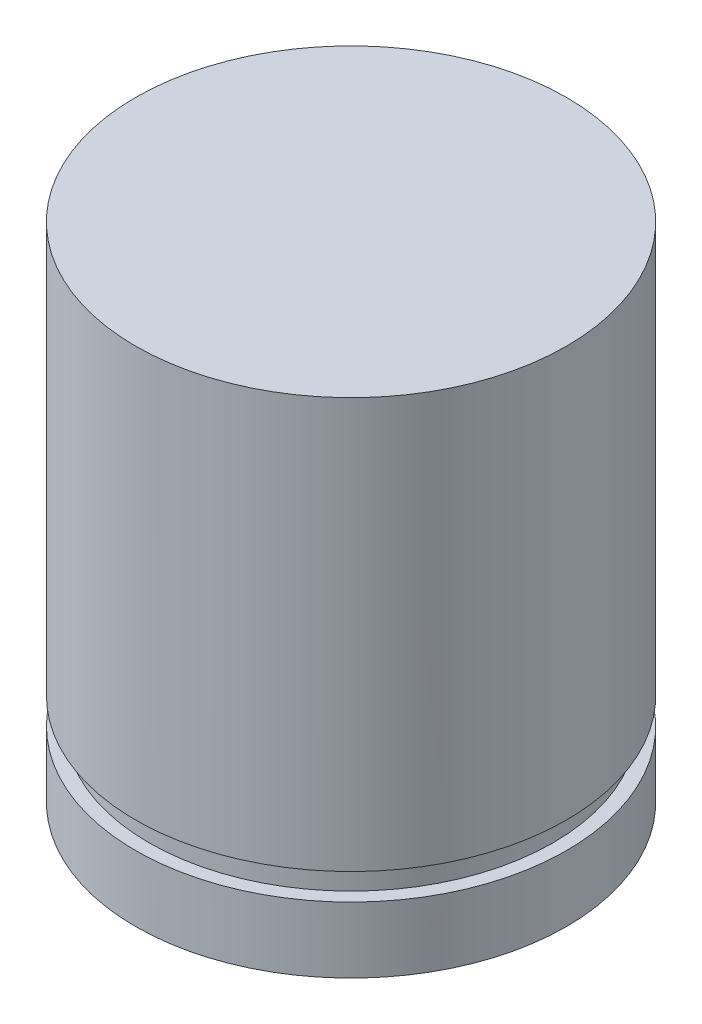
ISO-10303-21;
HEADER;
FILE_DESCRIPTION(('STEP AP214'),'2;1');
FILE_NAME('part.step','',(''),(''),'','','');
FILE_SCHEMA(('AUTOMOTIVE_DESIGN { 1 0 10303 214 1 1 1 1 }'));
ENDSEC;
DATA;
#1=APPLICATION_CONTEXT('core data for automotive mechanical design processes');
#2=APPLICATION_PROTOCOL_DEFINITION('international standard','automotive_design',2000,#1);
#3=PRODUCT_CONTEXT('',#1,'mechanical');
#4=PRODUCT('Part','Part','',(#3));
#5=PRODUCT_RELATED_PRODUCT_CATEGORY('part','',(#4));
#6=PRODUCT_DEFINITION_FORMATION('','',#4);
#7=PRODUCT_DEFINITION_CONTEXT('part definition',#1,'design');
#8=PRODUCT_DEFINITION('design','',#6,#7);
#9=PRODUCT_DEFINITION_SHAPE('','',#8);
#10=(LENGTH_UNIT() NAMED_UNIT(*) SI_UNIT(.MILLI.,.METRE.));
#11=(NAMED_UNIT(*) PLANE_ANGLE_UNIT() SI_UNIT($,.RADIAN.));
#12=(NAMED_UNIT(*) SI_UNIT($,.STERADIAN.) SOLID_ANGLE_UNIT());
#13=UNCERTAINTY_MEASURE_WITH_UNIT(LENGTH_MEASURE(1.E-05),#10,'distance_accuracy_value','');
#14=(GEOMETRIC_REPRESENTATION_CONTEXT(3) GLOBAL_UNCERTAINTY_ASSIGNED_CONTEXT((#13)) GLOBAL_UNIT_ASSIGNED_CONTEXT((#10,
#11,#12)) REPRESENTATION_CONTEXT('',''));
#15=CARTESIAN_POINT('',(0.,0.,0.));
#16=DIRECTION('',(0.,0.,1.));
#17=DIRECTION('',(1.,0.,0.));
#18=AXIS2_PLACEMENT_3D('',#15,#16,#17);
#19=CARTESIAN_POINT('',(0.,14.,0.));
#20=DIRECTION('',(0.,-1.,0.));
#21=DIRECTION('',(0.,0.,-1.));
#22=AXIS2_PLACEMENT_3D('',#19,#20,#21);
#23=CYLINDRICAL_SURFACE('',#22,6.);
#24=CARTESIAN_POINT('',(0.,1.8334,0.));
#25=DIRECTION('',(0.,-1.,0.));
#26=DIRECTION('',(0.,0.,-1.));
#27=AXIS2_PLACEMENT_3D('',#24,#25,#26);
#28=CIRCLE('',#27,6.);
#29=CARTESIAN_POINT('',(0.,1.8334,-6.));
#30=VERTEX_POINT('',#29);
#31=EDGE_CURVE('E33',#30,#30,#28,.T.);
#32=ORIENTED_EDGE('',*,*,#31,.T.);
#33=EDGE_LOOP('',(#32));
#34=FACE_BOUND('',#33,.T.);
#35=CARTESIAN_POINT('',(0.,0.,0.));
#36=DIRECTION('',(0.,1.,0.));
#37=DIRECTION('',(0.,0.,1.));
#38=AXIS2_PLACEMENT_3D('',#35,#36,#37);
#39=CIRCLE('',#38,6.);
#40=CARTESIAN_POINT('',(0.,0.,6.));
#41=VERTEX_POINT('',#40);
#42=EDGE_CURVE('E37',#41,#41,#39,.T.);
#43=ORIENTED_EDGE('',*,*,#42,.T.);
#44=EDGE_LOOP('',(#43));
#45=FACE_BOUND('',#44,.T.);
#46=ADVANCED_FACE('F30',(#34,#45),#23,.T.);
#47=CARTESIAN_POINT('',(0.,0.,0.));
#48=DIRECTION('',(0.,1.,0.));
#49=DIRECTION('',(0.,0.,1.));
#50=AXIS2_PLACEMENT_3D('',#47,#48,#49);
#51=PLANE('',#50);
#52=ORIENTED_EDGE('',*,*,#42,.F.);
#53=EDGE_LOOP('',(#52));
#54=FACE_BOUND('',#53,.T.);
#55=ADVANCED_FACE('F74',(#54),#51,.F.);
#56=CARTESIAN_POINT('',(0.,1.8334,0.));
#57=DIRECTION('',(0.,-1.,0.));
#58=DIRECTION('',(0.,0.,-1.));
#59=AXIS2_PLACEMENT_3D('',#56,#57,#58);
#60=PLANE('',#59);
#61=CARTESIAN_POINT('',(0.,1.8334,0.));
#62=DIRECTION('',(0.,1.,0.));
#63=DIRECTION('',(0.,0.,1.));
#64=AXIS2_PLACEMENT_3D('',#61,#62,#63);
#65=CIRCLE('',#64,5.6261);
#66=CARTESIAN_POINT('',(0.,1.8334,5.6261));
#67=VERTEX_POINT('',#66);
#68=EDGE_CURVE('E48',#67,#67,#65,.T.);
#69=ORIENTED_EDGE('',*,*,#68,.F.);
#70=EDGE_LOOP('',(#69));
#71=FACE_BOUND('',#70,.T.);
#72=ORIENTED_EDGE('',*,*,#31,.F.);
#73=EDGE_LOOP('',(#72));
#74=FACE_BOUND('',#73,.T.);
#75=ADVANCED_FACE('F70',(#71,#74),#60,.F.);
#76=CARTESIAN_POINT('',(0.,2.57,0.));
#77=DIRECTION('',(0.,-1.,0.));
#78=DIRECTION('',(0.,0.,-1.));
#79=AXIS2_PLACEMENT_3D('',#76,#77,#78);
#80=PLANE('',#79);
#81=CARTESIAN_POINT('',(0.,2.57,0.));
#82=DIRECTION('',(0.,1.,0.));
#83=DIRECTION('',(0.,0.,1.));
#84=AXIS2_PLACEMENT_3D('',#81,#82,#83);
#85=CIRCLE('',#84,5.6261);
#86=CARTESIAN_POINT('',(0.,2.57,5.6261));
#87=VERTEX_POINT('',#86);
#88=EDGE_CURVE('E44',#87,#87,#85,.T.);
#89=ORIENTED_EDGE('',*,*,#88,.T.);
#90=EDGE_LOOP('',(#89));
#91=FACE_BOUND('',#90,.T.);
#92=CARTESIAN_POINT('',(0.,2.57,0.));
#93=DIRECTION('',(0.,-1.,0.));
#94=DIRECTION('',(0.,0.,-1.));
#95=AXIS2_PLACEMENT_3D('',#92,#93,#94);
#96=CIRCLE('',#95,6.);
#97=CARTESIAN_POINT('',(0.,2.57,-6.));
#98=VERTEX_POINT('',#97);
#99=EDGE_CURVE('E46',#98,#98,#96,.T.);
#100=ORIENTED_EDGE('',*,*,#99,.T.);
#101=EDGE_LOOP('',(#100));
#102=FACE_BOUND('',#101,.T.);
#103=ADVANCED_FACE('F58',(#91,#102),#80,.T.);
#104=CARTESIAN_POINT('',(0.,1.8334,0.));
#105=DIRECTION('',(0.,1.,0.));
#106=DIRECTION('',(0.,0.,1.));
#107=AXIS2_PLACEMENT_3D('',#104,#105,#106);
#108=CYLINDRICAL_SURFACE('',#107,5.6261);
#109=ORIENTED_EDGE('',*,*,#68,.T.);
#110=EDGE_LOOP('',(#109));
#111=FACE_BOUND('',#110,.T.);
#112=ORIENTED_EDGE('',*,*,#88,.F.);
#113=EDGE_LOOP('',(#112));
#114=FACE_BOUND('',#113,.T.);
#115=ADVANCED_FACE('F60',(#111,#114),#108,.T.);
#116=CARTESIAN_POINT('',(0.,14.,0.));
#117=DIRECTION('',(0.,1.,0.));
#118=DIRECTION('',(0.,0.,1.));
#119=AXIS2_PLACEMENT_3D('',#116,#117,#118);
#120=PLANE('',#119);
#121=CARTESIAN_POINT('',(0.,14.,0.));
#122=DIRECTION('',(0.,1.,0.));
#123=DIRECTION('',(0.,0.,1.));
#124=AXIS2_PLACEMENT_3D('',#121,#122,#123);
#125=CIRCLE('',#124,6.);
#126=CARTESIAN_POINT('',(0.,14.,6.));
#127=VERTEX_POINT('',#126);
#128=EDGE_CURVE('E10',#127,#127,#125,.T.);
#129=ORIENTED_EDGE('',*,*,#128,.T.);
#130=EDGE_LOOP('',(#129));
#131=FACE_BOUND('',#130,.T.);
#132=ADVANCED_FACE('F62',(#131),#120,.T.);
#133=ORIENTED_EDGE('',*,*,#128,.F.);
#134=EDGE_LOOP('',(#133));
#135=FACE_BOUND('',#134,.T.);
#136=ORIENTED_EDGE('',*,*,#99,.F.);
#137=EDGE_LOOP('',(#136));
#138=FACE_BOUND('',#137,.T.);
#139=ADVANCED_FACE('F68',(#135,#138),#23,.T.);
#140=CLOSED_SHELL('',(#46,#55,#75,#103,#115,#132,#139));
#141=MANIFOLD_SOLID_BREP('B2',#140);
#142=ADVANCED_BREP_SHAPE_REPRESENTATION('',(#18,#141),#14);
#143=SHAPE_DEFINITION_REPRESENTATION(#9,#142);
ENDSEC;
END-ISO-10303-21;
